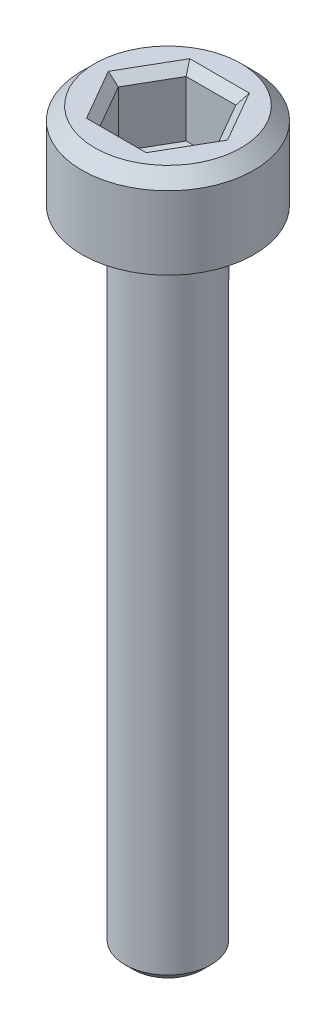
ISO-10303-21;
HEADER;
FILE_DESCRIPTION(('STEP AP214'),'2;1');
FILE_NAME('part.step','',(''),(''),'','','');
FILE_SCHEMA(('AUTOMOTIVE_DESIGN { 1 0 10303 214 1 1 1 1 }'));
ENDSEC;
DATA;
#1=APPLICATION_CONTEXT('core data for automotive mechanical design processes');
#2=APPLICATION_PROTOCOL_DEFINITION('international standard','automotive_design',2000,#1);
#3=PRODUCT_CONTEXT('',#1,'mechanical');
#4=PRODUCT('Part','Part','',(#3));
#5=PRODUCT_RELATED_PRODUCT_CATEGORY('part','',(#4));
#6=PRODUCT_DEFINITION_FORMATION('','',#4);
#7=PRODUCT_DEFINITION_CONTEXT('part definition',#1,'design');
#8=PRODUCT_DEFINITION('design','',#6,#7);
#9=PRODUCT_DEFINITION_SHAPE('','',#8);
#10=(LENGTH_UNIT() NAMED_UNIT(*) SI_UNIT(.MILLI.,.METRE.));
#11=(NAMED_UNIT(*) PLANE_ANGLE_UNIT() SI_UNIT($,.RADIAN.));
#12=(NAMED_UNIT(*) SI_UNIT($,.STERADIAN.) SOLID_ANGLE_UNIT());
#13=UNCERTAINTY_MEASURE_WITH_UNIT(LENGTH_MEASURE(1.E-05),#10,'distance_accuracy_value','');
#14=(GEOMETRIC_REPRESENTATION_CONTEXT(3) GLOBAL_UNCERTAINTY_ASSIGNED_CONTEXT((#13)) GLOBAL_UNIT_ASSIGNED_CONTEXT((#10,
#11,#12)) REPRESENTATION_CONTEXT('',''));
#15=CARTESIAN_POINT('',(0.,0.,0.));
#16=DIRECTION('',(0.,0.,1.));
#17=DIRECTION('',(1.,0.,0.));
#18=AXIS2_PLACEMENT_3D('',#15,#16,#17);
#19=CARTESIAN_POINT('',(0.,0.,0.));
#20=DIRECTION('',(0.,1.,0.));
#21=DIRECTION('',(0.,0.,1.));
#22=AXIS2_PLACEMENT_3D('',#19,#20,#21);
#23=PLANE('',#22);
#24=CARTESIAN_POINT('',(0.,0.,0.));
#25=DIRECTION('',(0.,1.,0.));
#26=DIRECTION('',(0.,0.,1.));
#27=AXIS2_PLACEMENT_3D('',#24,#25,#26);
#28=CIRCLE('',#27,2.);
#29=CARTESIAN_POINT('',(0.,0.,2.));
#30=VERTEX_POINT('',#29);
#31=EDGE_CURVE('E146',#30,#30,#28,.T.);
#32=ORIENTED_EDGE('',*,*,#31,.F.);
#33=EDGE_LOOP('',(#32));
#34=FACE_BOUND('',#33,.T.);
#35=CARTESIAN_POINT('',(0.,0.,0.));
#36=DIRECTION('',(0.,1.,0.));
#37=DIRECTION('',(0.,0.,1.));
#38=AXIS2_PLACEMENT_3D('',#35,#36,#37);
#39=CIRCLE('',#38,1.);
#40=CARTESIAN_POINT('',(0.,0.,1.));
#41=VERTEX_POINT('',#40);
#42=EDGE_CURVE('E185',#41,#41,#39,.F.);
#43=ORIENTED_EDGE('',*,*,#42,.F.);
#44=EDGE_LOOP('',(#43));
#45=FACE_BOUND('',#44,.T.);
#46=ADVANCED_FACE('F33',(#34,#45),#23,.F.);
#47=CARTESIAN_POINT('',(0.,2.,0.));
#48=DIRECTION('',(0.,-1.,0.));
#49=DIRECTION('',(0.,0.,-1.));
#50=AXIS2_PLACEMENT_3D('',#47,#48,#49);
#51=CYLINDRICAL_SURFACE('',#50,2.);
#52=CARTESIAN_POINT('',(0.,1.7,0.));
#53=DIRECTION('',(0.,1.,0.));
#54=DIRECTION('',(0.,0.,1.));
#55=AXIS2_PLACEMENT_3D('',#52,#53,#54);
#56=CIRCLE('',#55,2.);
#57=CARTESIAN_POINT('',(0.,1.7,2.));
#58=VERTEX_POINT('',#57);
#59=EDGE_CURVE('E160',#58,#58,#56,.F.);
#60=ORIENTED_EDGE('',*,*,#59,.T.);
#61=EDGE_LOOP('',(#60));
#62=FACE_BOUND('',#61,.T.);
#63=ORIENTED_EDGE('',*,*,#31,.T.);
#64=EDGE_LOOP('',(#63));
#65=FACE_BOUND('',#64,.T.);
#66=ADVANCED_FACE('F213',(#62,#65),#51,.T.);
#67=CARTESIAN_POINT('',(0.,2.,0.));
#68=DIRECTION('',(0.,1.,0.));
#69=DIRECTION('',(0.,0.,1.));
#70=AXIS2_PLACEMENT_3D('',#67,#68,#69);
#71=PLANE('',#70);
#72=DIRECTION('',(1.,0.,0.));
#73=VECTOR('',#72,1.);
#74=CARTESIAN_POINT('',(0.577350269189625,2.,-1.2));
#75=LINE('',#74,#73);
#76=CARTESIAN_POINT('',(-0.692820323027552,2.,-1.2));
#77=VERTEX_POINT('',#76);
#78=CARTESIAN_POINT('',(0.692820323027551,2.,-1.2));
#79=VERTEX_POINT('',#78);
#80=EDGE_CURVE('E165',#77,#79,#75,.T.);
#81=ORIENTED_EDGE('',*,*,#80,.T.);
#82=DIRECTION('',(0.5,0.,0.866025403784438));
#83=VECTOR('',#82,1.);
#84=CARTESIAN_POINT('',(1.32790561913614,2.,-0.100000000000001));
#85=LINE('',#84,#83);
#86=CARTESIAN_POINT('',(1.3856406460551,2.,0.));
#87=VERTEX_POINT('',#86);
#88=EDGE_CURVE('E175',#79,#87,#85,.T.);
#89=ORIENTED_EDGE('',*,*,#88,.T.);
#90=DIRECTION('',(-0.5,0.,0.866025403784439));
#91=VECTOR('',#90,1.);
#92=CARTESIAN_POINT('',(0.750555349946515,2.,1.1));
#93=LINE('',#92,#91);
#94=CARTESIAN_POINT('',(0.692820323027551,2.,1.2));
#95=VERTEX_POINT('',#94);
#96=EDGE_CURVE('E173',#87,#95,#93,.T.);
#97=ORIENTED_EDGE('',*,*,#96,.T.);
#98=DIRECTION('',(-1.,0.,0.));
#99=VECTOR('',#98,1.);
#100=CARTESIAN_POINT('',(-0.577350269189626,2.,1.2));
#101=LINE('',#100,#99);
#102=CARTESIAN_POINT('',(-0.692820323027551,2.,1.2));
#103=VERTEX_POINT('',#102);
#104=EDGE_CURVE('E171',#95,#103,#101,.T.);
#105=ORIENTED_EDGE('',*,*,#104,.T.);
#106=DIRECTION('',(-0.5,0.,-0.866025403784439));
#107=VECTOR('',#106,1.);
#108=CARTESIAN_POINT('',(-1.32790561913614,2.,0.100000000000001));
#109=LINE('',#108,#107);
#110=CARTESIAN_POINT('',(-1.3856406460551,2.,0.));
#111=VERTEX_POINT('',#110);
#112=EDGE_CURVE('E169',#103,#111,#109,.T.);
#113=ORIENTED_EDGE('',*,*,#112,.T.);
#114=DIRECTION('',(0.5,0.,-0.866025403784439));
#115=VECTOR('',#114,1.);
#116=CARTESIAN_POINT('',(-0.750555349946515,2.,-1.1));
#117=LINE('',#116,#115);
#118=EDGE_CURVE('E167',#111,#77,#117,.T.);
#119=ORIENTED_EDGE('',*,*,#118,.T.);
#120=EDGE_LOOP('',(#81,#89,#97,#105,#113,#119));
#121=FACE_BOUND('',#120,.T.);
#122=CARTESIAN_POINT('',(0.,2.,0.));
#123=DIRECTION('',(0.,1.,0.));
#124=DIRECTION('',(0.,0.,1.));
#125=AXIS2_PLACEMENT_3D('',#122,#123,#124);
#126=CIRCLE('',#125,1.7);
#127=CARTESIAN_POINT('',(0.,2.,1.7));
#128=VERTEX_POINT('',#127);
#129=EDGE_CURVE('E157',#128,#128,#126,.T.);
#130=ORIENTED_EDGE('',*,*,#129,.T.);
#131=EDGE_LOOP('',(#130));
#132=FACE_BOUND('',#131,.T.);
#133=ADVANCED_FACE('F219',(#121,#132),#71,.T.);
#134=CARTESIAN_POINT('',(0.,2.,0.));
#135=DIRECTION('',(0.,-1.,0.));
#136=DIRECTION('',(0.,0.,-1.));
#137=AXIS2_PLACEMENT_3D('',#134,#135,#136);
#138=CONICAL_SURFACE('',#137,1.7,0.785398163397447);
#139=ORIENTED_EDGE('',*,*,#59,.F.);
#140=EDGE_LOOP('',(#139));
#141=FACE_BOUND('',#140,.T.);
#142=ORIENTED_EDGE('',*,*,#129,.F.);
#143=EDGE_LOOP('',(#142));
#144=FACE_BOUND('',#143,.T.);
#145=ADVANCED_FACE('F227',(#141,#144),#138,.T.);
#146=CARTESIAN_POINT('',(0.577350269189626,0.5,1.));
#147=DIRECTION('',(0.866025403784439,0.,0.5));
#148=DIRECTION('',(0.5,0.,-0.866025403784439));
#149=AXIS2_PLACEMENT_3D('',#146,#147,#148);
#150=PLANE('',#149);
#151=DIRECTION('',(0.,1.,0.));
#152=VECTOR('',#151,1.);
#153=CARTESIAN_POINT('',(0.577350269189626,0.5,1.));
#154=LINE('',#153,#152);
#155=CARTESIAN_POINT('',(0.577350269189626,0.5,1.));
#156=VERTEX_POINT('',#155);
#157=CARTESIAN_POINT('',(0.577350269189626,1.8,1.));
#158=VERTEX_POINT('',#157);
#159=EDGE_CURVE('E144',#156,#158,#154,.T.);
#160=ORIENTED_EDGE('',*,*,#159,.T.);
#161=DIRECTION('',(0.5,0.,-0.866025403784439));
#162=VECTOR('',#161,1.);
#163=CARTESIAN_POINT('',(1.15470053837925,1.8,0.));
#164=LINE('',#163,#162);
#165=CARTESIAN_POINT('',(1.15470053837925,1.8,0.));
#166=VERTEX_POINT('',#165);
#167=EDGE_CURVE('E113',#158,#166,#164,.T.);
#168=ORIENTED_EDGE('',*,*,#167,.T.);
#169=DIRECTION('',(0.,1.,0.));
#170=VECTOR('',#169,1.);
#171=CARTESIAN_POINT('',(1.15470053837925,0.5,0.));
#172=LINE('',#171,#170);
#173=CARTESIAN_POINT('',(1.15470053837925,0.5,0.));
#174=VERTEX_POINT('',#173);
#175=EDGE_CURVE('E105',#174,#166,#172,.T.);
#176=ORIENTED_EDGE('',*,*,#175,.F.);
#177=DIRECTION('',(0.5,0.,-0.866025403784439));
#178=VECTOR('',#177,1.);
#179=CARTESIAN_POINT('',(0.577350269189626,0.5,1.));
#180=LINE('',#179,#178);
#181=EDGE_CURVE('E110',#156,#174,#180,.T.);
#182=ORIENTED_EDGE('',*,*,#181,.F.);
#183=EDGE_LOOP('',(#160,#168,#176,#182));
#184=FACE_BOUND('',#183,.T.);
#185=ADVANCED_FACE('F108',(#184),#150,.F.);
#186=CARTESIAN_POINT('',(-0.577350269189626,0.5,1.));
#187=DIRECTION('',(0.,0.,1.));
#188=DIRECTION('',(1.,0.,0.));
#189=AXIS2_PLACEMENT_3D('',#186,#187,#188);
#190=PLANE('',#189);
#191=DIRECTION('',(0.,1.,0.));
#192=VECTOR('',#191,1.);
#193=CARTESIAN_POINT('',(-0.577350269189626,0.5,1.));
#194=LINE('',#193,#192);
#195=CARTESIAN_POINT('',(-0.577350269189626,0.5,1.));
#196=VERTEX_POINT('',#195);
#197=CARTESIAN_POINT('',(-0.577350269189626,1.8,1.));
#198=VERTEX_POINT('',#197);
#199=EDGE_CURVE('E147',#196,#198,#194,.T.);
#200=ORIENTED_EDGE('',*,*,#199,.T.);
#201=DIRECTION('',(1.,0.,0.));
#202=VECTOR('',#201,1.);
#203=CARTESIAN_POINT('',(0.577350269189626,1.8,1.));
#204=LINE('',#203,#202);
#205=EDGE_CURVE('E179',#198,#158,#204,.T.);
#206=ORIENTED_EDGE('',*,*,#205,.T.);
#207=ORIENTED_EDGE('',*,*,#159,.F.);
#208=DIRECTION('',(1.,0.,0.));
#209=VECTOR('',#208,1.);
#210=CARTESIAN_POINT('',(-0.577350269189626,0.5,1.));
#211=LINE('',#210,#209);
#212=EDGE_CURVE('E118',#196,#156,#211,.T.);
#213=ORIENTED_EDGE('',*,*,#212,.F.);
#214=EDGE_LOOP('',(#200,#206,#207,#213));
#215=FACE_BOUND('',#214,.T.);
#216=ADVANCED_FACE('F280',(#215),#190,.F.);
#217=CARTESIAN_POINT('',(-1.15470053837925,0.5,0.));
#218=DIRECTION('',(-0.866025403784438,0.,0.5));
#219=DIRECTION('',(0.5,0.,0.866025403784439));
#220=AXIS2_PLACEMENT_3D('',#217,#218,#219);
#221=PLANE('',#220);
#222=DIRECTION('',(0.,1.,0.));
#223=VECTOR('',#222,1.);
#224=CARTESIAN_POINT('',(-1.15470053837925,0.5,0.));
#225=LINE('',#224,#223);
#226=CARTESIAN_POINT('',(-1.15470053837925,0.5,0.));
#227=VERTEX_POINT('',#226);
#228=CARTESIAN_POINT('',(-1.15470053837925,1.8,0.));
#229=VERTEX_POINT('',#228);
#230=EDGE_CURVE('E150',#227,#229,#225,.T.);
#231=ORIENTED_EDGE('',*,*,#230,.T.);
#232=DIRECTION('',(0.5,0.,0.866025403784439));
#233=VECTOR('',#232,1.);
#234=CARTESIAN_POINT('',(-0.577350269189626,1.8,1.));
#235=LINE('',#234,#233);
#236=EDGE_CURVE('E181',#229,#198,#235,.T.);
#237=ORIENTED_EDGE('',*,*,#236,.T.);
#238=ORIENTED_EDGE('',*,*,#199,.F.);
#239=DIRECTION('',(0.5,0.,0.866025403784439));
#240=VECTOR('',#239,1.);
#241=CARTESIAN_POINT('',(-1.15470053837925,0.5,0.));
#242=LINE('',#241,#240);
#243=EDGE_CURVE('E141',#227,#196,#242,.T.);
#244=ORIENTED_EDGE('',*,*,#243,.F.);
#245=EDGE_LOOP('',(#231,#237,#238,#244));
#246=FACE_BOUND('',#245,.T.);
#247=ADVANCED_FACE('F278',(#246),#221,.F.);
#248=CARTESIAN_POINT('',(-0.577350269189626,0.5,-1.));
#249=DIRECTION('',(-0.866025403784439,0.,-0.5));
#250=DIRECTION('',(-0.5,0.,0.866025403784439));
#251=AXIS2_PLACEMENT_3D('',#248,#249,#250);
#252=PLANE('',#251);
#253=DIRECTION('',(0.,1.,0.));
#254=VECTOR('',#253,1.);
#255=CARTESIAN_POINT('',(-0.577350269189626,0.5,-1.));
#256=LINE('',#255,#254);
#257=CARTESIAN_POINT('',(-0.577350269189626,0.5,-1.));
#258=VERTEX_POINT('',#257);
#259=CARTESIAN_POINT('',(-0.577350269189626,1.8,-1.));
#260=VERTEX_POINT('',#259);
#261=EDGE_CURVE('E152',#258,#260,#256,.T.);
#262=ORIENTED_EDGE('',*,*,#261,.T.);
#263=DIRECTION('',(-0.5,0.,0.866025403784439));
#264=VECTOR('',#263,1.);
#265=CARTESIAN_POINT('',(-1.15470053837925,1.8,0.));
#266=LINE('',#265,#264);
#267=EDGE_CURVE('E55',#260,#229,#266,.T.);
#268=ORIENTED_EDGE('',*,*,#267,.T.);
#269=ORIENTED_EDGE('',*,*,#230,.F.);
#270=DIRECTION('',(-0.5,0.,0.866025403784439));
#271=VECTOR('',#270,1.);
#272=CARTESIAN_POINT('',(-0.577350269189626,0.5,-1.));
#273=LINE('',#272,#271);
#274=EDGE_CURVE('E138',#258,#227,#273,.T.);
#275=ORIENTED_EDGE('',*,*,#274,.F.);
#276=EDGE_LOOP('',(#262,#268,#269,#275));
#277=FACE_BOUND('',#276,.T.);
#278=ADVANCED_FACE('F276',(#277),#252,.F.);
#279=CARTESIAN_POINT('',(0.577350269189625,0.5,-1.));
#280=DIRECTION('',(0.,0.,-1.));
#281=DIRECTION('',(-1.,0.,0.));
#282=AXIS2_PLACEMENT_3D('',#279,#280,#281);
#283=PLANE('',#282);
#284=DIRECTION('',(0.,1.,0.));
#285=VECTOR('',#284,1.);
#286=CARTESIAN_POINT('',(0.577350269189625,0.5,-1.));
#287=LINE('',#286,#285);
#288=CARTESIAN_POINT('',(0.577350269189625,0.5,-1.));
#289=VERTEX_POINT('',#288);
#290=CARTESIAN_POINT('',(0.577350269189625,1.8,-1.));
#291=VERTEX_POINT('',#290);
#292=EDGE_CURVE('E117',#289,#291,#287,.T.);
#293=ORIENTED_EDGE('',*,*,#292,.T.);
#294=DIRECTION('',(-1.,0.,0.));
#295=VECTOR('',#294,1.);
#296=CARTESIAN_POINT('',(-0.577350269189626,1.8,-1.));
#297=LINE('',#296,#295);
#298=EDGE_CURVE('E48',#291,#260,#297,.T.);
#299=ORIENTED_EDGE('',*,*,#298,.T.);
#300=ORIENTED_EDGE('',*,*,#261,.F.);
#301=DIRECTION('',(-1.,0.,0.));
#302=VECTOR('',#301,1.);
#303=CARTESIAN_POINT('',(0.577350269189625,0.5,-1.));
#304=LINE('',#303,#302);
#305=EDGE_CURVE('E126',#289,#258,#304,.T.);
#306=ORIENTED_EDGE('',*,*,#305,.F.);
#307=EDGE_LOOP('',(#293,#299,#300,#306));
#308=FACE_BOUND('',#307,.T.);
#309=ADVANCED_FACE('F273',(#308),#283,.F.);
#310=CARTESIAN_POINT('',(1.15470053837925,0.5,0.));
#311=DIRECTION('',(0.866025403784438,0.,-0.5));
#312=DIRECTION('',(-0.5,0.,-0.866025403784439));
#313=AXIS2_PLACEMENT_3D('',#310,#311,#312);
#314=PLANE('',#313);
#315=ORIENTED_EDGE('',*,*,#175,.T.);
#316=DIRECTION('',(-0.5,0.,-0.866025403784439));
#317=VECTOR('',#316,1.);
#318=CARTESIAN_POINT('',(0.577350269189625,1.8,-1.));
#319=LINE('',#318,#317);
#320=EDGE_CURVE('E163',#166,#291,#319,.T.);
#321=ORIENTED_EDGE('',*,*,#320,.T.);
#322=ORIENTED_EDGE('',*,*,#292,.F.);
#323=DIRECTION('',(-0.5,0.,-0.866025403784438));
#324=VECTOR('',#323,1.);
#325=CARTESIAN_POINT('',(1.15470053837925,0.5,0.));
#326=LINE('',#325,#324);
#327=EDGE_CURVE('E121',#174,#289,#326,.T.);
#328=ORIENTED_EDGE('',*,*,#327,.F.);
#329=EDGE_LOOP('',(#315,#321,#322,#328));
#330=FACE_BOUND('',#329,.T.);
#331=ADVANCED_FACE('F122',(#330),#314,.F.);
#332=CARTESIAN_POINT('',(0.,0.5,0.));
#333=DIRECTION('',(0.,1.,0.));
#334=DIRECTION('',(0.,0.,1.));
#335=AXIS2_PLACEMENT_3D('',#332,#333,#334);
#336=PLANE('',#335);
#337=ORIENTED_EDGE('',*,*,#181,.T.);
#338=ORIENTED_EDGE('',*,*,#327,.T.);
#339=ORIENTED_EDGE('',*,*,#305,.T.);
#340=ORIENTED_EDGE('',*,*,#274,.T.);
#341=ORIENTED_EDGE('',*,*,#243,.T.);
#342=ORIENTED_EDGE('',*,*,#212,.T.);
#343=EDGE_LOOP('',(#337,#338,#339,#340,#341,#342));
#344=FACE_BOUND('',#343,.T.);
#345=ADVANCED_FACE('F128',(#344),#336,.T.);
#346=CARTESIAN_POINT('',(-1.15470053837925,1.8,0.));
#347=DIRECTION('',(0.612372435695792,0.70710678118655,-0.353553390593273));
#348=DIRECTION('',(-0.5,0.,-0.866025403784439));
#349=AXIS2_PLACEMENT_3D('',#346,#347,#348);
#350=PLANE('',#349);
#351=DIRECTION('',(0.755928946018457,-0.654653670707974,0.));
#352=VECTOR('',#351,1.);
#353=CARTESIAN_POINT('',(-1.15470053837925,1.8,0.));
#354=LINE('',#353,#352);
#355=EDGE_CURVE('E134',#111,#229,#354,.T.);
#356=ORIENTED_EDGE('',*,*,#355,.F.);
#357=ORIENTED_EDGE('',*,*,#112,.F.);
#358=DIRECTION('',(0.377964473009227,-0.654653670707974,-0.654653670707981));
#359=VECTOR('',#358,1.);
#360=CARTESIAN_POINT('',(-0.577350269189626,1.8,1.));
#361=LINE('',#360,#359);
#362=EDGE_CURVE('E131',#198,#103,#361,.F.);
#363=ORIENTED_EDGE('',*,*,#362,.F.);
#364=ORIENTED_EDGE('',*,*,#236,.F.);
#365=EDGE_LOOP('',(#356,#357,#363,#364));
#366=FACE_BOUND('',#365,.T.);
#367=ADVANCED_FACE('F249',(#366),#350,.T.);
#368=CARTESIAN_POINT('',(-0.577350269189626,1.8,1.));
#369=DIRECTION('',(0.,0.707106781186551,-0.707106781186544));
#370=DIRECTION('',(-1.,0.,0.));
#371=AXIS2_PLACEMENT_3D('',#368,#369,#370);
#372=PLANE('',#371);
#373=ORIENTED_EDGE('',*,*,#362,.T.);
#374=ORIENTED_EDGE('',*,*,#104,.F.);
#375=DIRECTION('',(-0.377964473009228,-0.654653670707974,-0.654653670707981));
#376=VECTOR('',#375,1.);
#377=CARTESIAN_POINT('',(0.577350269189626,1.8,1.));
#378=LINE('',#377,#376);
#379=EDGE_CURVE('E193',#158,#95,#378,.F.);
#380=ORIENTED_EDGE('',*,*,#379,.F.);
#381=ORIENTED_EDGE('',*,*,#205,.F.);
#382=EDGE_LOOP('',(#373,#374,#380,#381));
#383=FACE_BOUND('',#382,.T.);
#384=ADVANCED_FACE('F246',(#383),#372,.T.);
#385=CARTESIAN_POINT('',(-0.577350269189626,1.8,-1.));
#386=DIRECTION('',(0.612372435695792,0.70710678118655,0.353553390593272));
#387=DIRECTION('',(0.5,0.,-0.866025403784439));
#388=AXIS2_PLACEMENT_3D('',#385,#386,#387);
#389=PLANE('',#388);
#390=ORIENTED_EDGE('',*,*,#355,.T.);
#391=ORIENTED_EDGE('',*,*,#267,.F.);
#392=DIRECTION('',(0.377964473009228,-0.654653670707974,0.65465367070798));
#393=VECTOR('',#392,1.);
#394=CARTESIAN_POINT('',(-0.577350269189626,1.8,-1.));
#395=LINE('',#394,#393);
#396=EDGE_CURVE('E190',#77,#260,#395,.T.);
#397=ORIENTED_EDGE('',*,*,#396,.F.);
#398=ORIENTED_EDGE('',*,*,#118,.F.);
#399=EDGE_LOOP('',(#390,#391,#397,#398));
#400=FACE_BOUND('',#399,.T.);
#401=ADVANCED_FACE('F242',(#400),#389,.T.);
#402=CARTESIAN_POINT('',(0.577350269189626,1.8,1.));
#403=DIRECTION('',(-0.612372435695792,0.70710678118655,-0.353553390593272));
#404=DIRECTION('',(-0.5,0.,0.866025403784439));
#405=AXIS2_PLACEMENT_3D('',#402,#403,#404);
#406=PLANE('',#405);
#407=ORIENTED_EDGE('',*,*,#379,.T.);
#408=ORIENTED_EDGE('',*,*,#96,.F.);
#409=DIRECTION('',(-0.755928946018457,-0.654653670707974,0.));
#410=VECTOR('',#409,1.);
#411=CARTESIAN_POINT('',(1.15470053837925,1.8,0.));
#412=LINE('',#411,#410);
#413=EDGE_CURVE('E188',#166,#87,#412,.F.);
#414=ORIENTED_EDGE('',*,*,#413,.F.);
#415=ORIENTED_EDGE('',*,*,#167,.F.);
#416=EDGE_LOOP('',(#407,#408,#414,#415));
#417=FACE_BOUND('',#416,.T.);
#418=ADVANCED_FACE('F238',(#417),#406,.T.);
#419=CARTESIAN_POINT('',(0.577350269189625,1.8,-1.));
#420=DIRECTION('',(0.,0.707106781186551,0.707106781186544));
#421=DIRECTION('',(1.,0.,0.));
#422=AXIS2_PLACEMENT_3D('',#419,#420,#421);
#423=PLANE('',#422);
#424=ORIENTED_EDGE('',*,*,#396,.T.);
#425=ORIENTED_EDGE('',*,*,#298,.F.);
#426=DIRECTION('',(0.377964473009229,0.654653670707974,-0.65465367070798));
#427=VECTOR('',#426,1.);
#428=CARTESIAN_POINT('',(0.41239304942116,1.51428571428571,-0.714285714285713));
#429=LINE('',#428,#427);
#430=EDGE_CURVE('E186',#79,#291,#429,.F.);
#431=ORIENTED_EDGE('',*,*,#430,.F.);
#432=ORIENTED_EDGE('',*,*,#80,.F.);
#433=EDGE_LOOP('',(#424,#425,#431,#432));
#434=FACE_BOUND('',#433,.T.);
#435=ADVANCED_FACE('F234',(#434),#423,.T.);
#436=CARTESIAN_POINT('',(1.15470053837925,1.8,0.));
#437=DIRECTION('',(-0.612372435695792,0.707106781186551,0.353553390593272));
#438=DIRECTION('',(0.5,0.,0.866025403784439));
#439=AXIS2_PLACEMENT_3D('',#436,#437,#438);
#440=PLANE('',#439);
#441=ORIENTED_EDGE('',*,*,#413,.T.);
#442=ORIENTED_EDGE('',*,*,#88,.F.);
#443=ORIENTED_EDGE('',*,*,#430,.T.);
#444=ORIENTED_EDGE('',*,*,#320,.F.);
#445=EDGE_LOOP('',(#441,#442,#443,#444));
#446=FACE_BOUND('',#445,.T.);
#447=ADVANCED_FACE('F231',(#446),#440,.T.);
#448=CARTESIAN_POINT('',(0.,-15.,0.));
#449=DIRECTION('',(0.,1.,0.));
#450=DIRECTION('',(0.,0.,1.));
#451=AXIS2_PLACEMENT_3D('',#448,#449,#450);
#452=CYLINDRICAL_SURFACE('',#451,1.);
#453=CARTESIAN_POINT('',(0.,-14.8,0.));
#454=DIRECTION('',(0.,-1.,0.));
#455=DIRECTION('',(0.,0.,-1.));
#456=AXIS2_PLACEMENT_3D('',#453,#454,#455);
#457=CIRCLE('',#456,1.);
#458=CARTESIAN_POINT('',(0.,-14.8,-1.));
#459=VERTEX_POINT('',#458);
#460=EDGE_CURVE('E11',#459,#459,#457,.F.);
#461=ORIENTED_EDGE('',*,*,#460,.T.);
#462=EDGE_LOOP('',(#461));
#463=FACE_BOUND('',#462,.T.);
#464=ORIENTED_EDGE('',*,*,#42,.T.);
#465=EDGE_LOOP('',(#464));
#466=FACE_BOUND('',#465,.T.);
#467=ADVANCED_FACE('F209',(#463,#466),#452,.T.);
#468=CARTESIAN_POINT('',(0.,-15.,0.));
#469=DIRECTION('',(0.,-1.,0.));
#470=DIRECTION('',(0.,0.,-1.));
#471=AXIS2_PLACEMENT_3D('',#468,#469,#470);
#472=PLANE('',#471);
#473=CARTESIAN_POINT('',(0.,-15.,0.));
#474=DIRECTION('',(0.,-1.,0.));
#475=DIRECTION('',(0.,0.,-1.));
#476=AXIS2_PLACEMENT_3D('',#473,#474,#475);
#477=CIRCLE('',#476,0.799999999999999);
#478=CARTESIAN_POINT('',(0.,-15.,-0.799999999999999));
#479=VERTEX_POINT('',#478);
#480=EDGE_CURVE('E41',#479,#479,#477,.T.);
#481=ORIENTED_EDGE('',*,*,#480,.T.);
#482=EDGE_LOOP('',(#481));
#483=FACE_BOUND('',#482,.T.);
#484=ADVANCED_FACE('F202',(#483),#472,.T.);
#485=CARTESIAN_POINT('',(0.,-15.,0.));
#486=DIRECTION('',(0.,1.,0.));
#487=DIRECTION('',(0.,0.,1.));
#488=AXIS2_PLACEMENT_3D('',#485,#486,#487);
#489=CONICAL_SURFACE('',#488,0.799999999999999,0.78539816339745);
#490=ORIENTED_EDGE('',*,*,#460,.F.);
#491=EDGE_LOOP('',(#490));
#492=FACE_BOUND('',#491,.T.);
#493=ORIENTED_EDGE('',*,*,#480,.F.);
#494=EDGE_LOOP('',(#493));
#495=FACE_BOUND('',#494,.T.);
#496=ADVANCED_FACE('F35',(#492,#495),#489,.T.);
#497=CLOSED_SHELL('',(#46,#66,#133,#145,#185,#216,#247,#278,#309,#331,#345,#367,#384,#401,#418,
#435,#447,#467,#484,#496));
#498=MANIFOLD_SOLID_BREP('B2',#497);
#499=ADVANCED_BREP_SHAPE_REPRESENTATION('',(#18,#498),#14);
#500=SHAPE_DEFINITION_REPRESENTATION(#9,#499);
ENDSEC;
END-ISO-10303-21;
